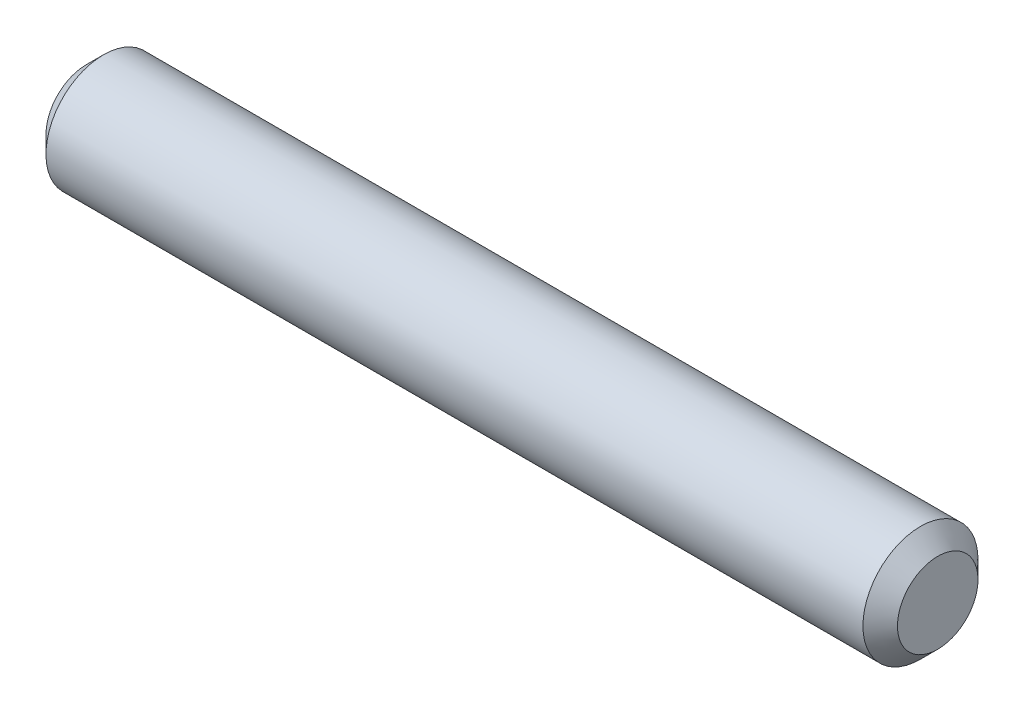
ISO-10303-21;
HEADER;
FILE_DESCRIPTION(('STEP AP214'),'2;1');
FILE_NAME('part.step','',(''),(''),'','','');
FILE_SCHEMA(('AUTOMOTIVE_DESIGN { 1 0 10303 214 1 1 1 1 }'));
ENDSEC;
DATA;
#1=APPLICATION_CONTEXT('core data for automotive mechanical design processes');
#2=APPLICATION_PROTOCOL_DEFINITION('international standard','automotive_design',2000,#1);
#3=PRODUCT_CONTEXT('',#1,'mechanical');
#4=PRODUCT('Part','Part','',(#3));
#5=PRODUCT_RELATED_PRODUCT_CATEGORY('part','',(#4));
#6=PRODUCT_DEFINITION_FORMATION('','',#4);
#7=PRODUCT_DEFINITION_CONTEXT('part definition',#1,'design');
#8=PRODUCT_DEFINITION('design','',#6,#7);
#9=PRODUCT_DEFINITION_SHAPE('','',#8);
#10=(LENGTH_UNIT() NAMED_UNIT(*) SI_UNIT(.MILLI.,.METRE.));
#11=(NAMED_UNIT(*) PLANE_ANGLE_UNIT() SI_UNIT($,.RADIAN.));
#12=(NAMED_UNIT(*) SI_UNIT($,.STERADIAN.) SOLID_ANGLE_UNIT());
#13=UNCERTAINTY_MEASURE_WITH_UNIT(LENGTH_MEASURE(1.E-05),#10,'distance_accuracy_value','');
#14=(GEOMETRIC_REPRESENTATION_CONTEXT(3) GLOBAL_UNCERTAINTY_ASSIGNED_CONTEXT((#13)) GLOBAL_UNIT_ASSIGNED_CONTEXT((#10,
#11,#12)) REPRESENTATION_CONTEXT('',''));
#15=CARTESIAN_POINT('',(0.,0.,0.));
#16=DIRECTION('',(0.,0.,1.));
#17=DIRECTION('',(1.,0.,0.));
#18=AXIS2_PLACEMENT_3D('',#15,#16,#17);
#19=CARTESIAN_POINT('',(7.4,0.,0.));
#20=DIRECTION('',(1.,0.,0.));
#21=DIRECTION('',(0.,1.,0.));
#22=AXIS2_PLACEMENT_3D('',#19,#20,#21);
#23=PLANE('',#22);
#24=CARTESIAN_POINT('',(7.40000000013197,0.,0.));
#25=DIRECTION('',(-1.,0.,0.));
#26=DIRECTION('',(0.,-1.,0.));
#27=AXIS2_PLACEMENT_3D('',#24,#25,#26);
#28=CIRCLE('',#27,0.699994293256623);
#29=CARTESIAN_POINT('',(7.40000000013197,-0.699994293256624,0.));
#30=VERTEX_POINT('',#29);
#31=EDGE_CURVE('E17',#30,#30,#28,.T.);
#32=ORIENTED_EDGE('',*,*,#31,.F.);
#33=EDGE_LOOP('',(#32));
#34=FACE_BOUND('',#33,.T.);
#35=ADVANCED_FACE('F14',(#34),#23,.T.);
#36=CARTESIAN_POINT('',(-7.4,0.,0.));
#37=DIRECTION('',(1.,0.,0.));
#38=DIRECTION('',(0.,1.,0.));
#39=AXIS2_PLACEMENT_3D('',#36,#37,#38);
#40=PLANE('',#39);
#41=CARTESIAN_POINT('',(-7.40000000013197,0.,0.));
#42=DIRECTION('',(1.,0.,0.));
#43=DIRECTION('',(0.,1.,0.));
#44=AXIS2_PLACEMENT_3D('',#41,#42,#43);
#45=CIRCLE('',#44,0.699994293256623);
#46=CARTESIAN_POINT('',(-7.40000000013197,0.699994293256624,0.));
#47=VERTEX_POINT('',#46);
#48=EDGE_CURVE('E26',#47,#47,#45,.T.);
#49=ORIENTED_EDGE('',*,*,#48,.F.);
#50=EDGE_LOOP('',(#49));
#51=FACE_BOUND('',#50,.T.);
#52=ADVANCED_FACE('F37',(#51),#40,.F.);
#53=CARTESIAN_POINT('',(7.09999184755361,0.,0.));
#54=DIRECTION('',(-1.,0.,0.));
#55=DIRECTION('',(0.,-1.,0.));
#56=AXIS2_PLACEMENT_3D('',#53,#54,#55);
#57=CONICAL_SURFACE('',#56,1.00000000009004,0.785394087250036);
#58=CARTESIAN_POINT('',(7.0999918476715,0.,0.));
#59=DIRECTION('',(1.,0.,0.));
#60=DIRECTION('',(0.,1.,0.));
#61=AXIS2_PLACEMENT_3D('',#58,#59,#60);
#62=CIRCLE('',#61,1.);
#63=CARTESIAN_POINT('',(7.0999918476715,0.999999999999999,0.));
#64=VERTEX_POINT('',#63);
#65=EDGE_CURVE('E21',#64,#64,#62,.F.);
#66=ORIENTED_EDGE('',*,*,#65,.F.);
#67=EDGE_LOOP('',(#66));
#68=FACE_BOUND('',#67,.T.);
#69=ORIENTED_EDGE('',*,*,#31,.T.);
#70=EDGE_LOOP('',(#69));
#71=FACE_BOUND('',#70,.T.);
#72=ADVANCED_FACE('F34',(#68,#71),#57,.T.);
#73=CARTESIAN_POINT('',(-7.09999184755361,0.,0.));
#74=DIRECTION('',(1.,0.,0.));
#75=DIRECTION('',(0.,1.,0.));
#76=AXIS2_PLACEMENT_3D('',#73,#74,#75);
#77=CONICAL_SURFACE('',#76,1.00000000009004,0.785394087250036);
#78=CARTESIAN_POINT('',(-7.0999918476715,0.,0.));
#79=DIRECTION('',(1.,0.,0.));
#80=DIRECTION('',(0.,1.,0.));
#81=AXIS2_PLACEMENT_3D('',#78,#79,#80);
#82=CIRCLE('',#81,1.);
#83=CARTESIAN_POINT('',(-7.0999918476715,1.,0.));
#84=VERTEX_POINT('',#83);
#85=EDGE_CURVE('E10',#84,#84,#82,.T.);
#86=ORIENTED_EDGE('',*,*,#85,.F.);
#87=EDGE_LOOP('',(#86));
#88=FACE_BOUND('',#87,.T.);
#89=ORIENTED_EDGE('',*,*,#48,.T.);
#90=EDGE_LOOP('',(#89));
#91=FACE_BOUND('',#90,.T.);
#92=ADVANCED_FACE('F45',(#88,#91),#77,.T.);
#93=CARTESIAN_POINT('',(-7.4,0.,0.));
#94=DIRECTION('',(1.,0.,0.));
#95=DIRECTION('',(0.,1.,0.));
#96=AXIS2_PLACEMENT_3D('',#93,#94,#95);
#97=CYLINDRICAL_SURFACE('',#96,1.);
#98=ORIENTED_EDGE('',*,*,#85,.T.);
#99=EDGE_LOOP('',(#98));
#100=FACE_BOUND('',#99,.T.);
#101=ORIENTED_EDGE('',*,*,#65,.T.);
#102=EDGE_LOOP('',(#101));
#103=FACE_BOUND('',#102,.T.);
#104=ADVANCED_FACE('F43',(#100,#103),#97,.T.);
#105=CLOSED_SHELL('',(#35,#52,#72,#92,#104));
#106=MANIFOLD_SOLID_BREP('B1',#105);
#107=ADVANCED_BREP_SHAPE_REPRESENTATION('',(#18,#106),#14);
#108=SHAPE_DEFINITION_REPRESENTATION(#9,#107);
ENDSEC;
END-ISO-10303-21;
